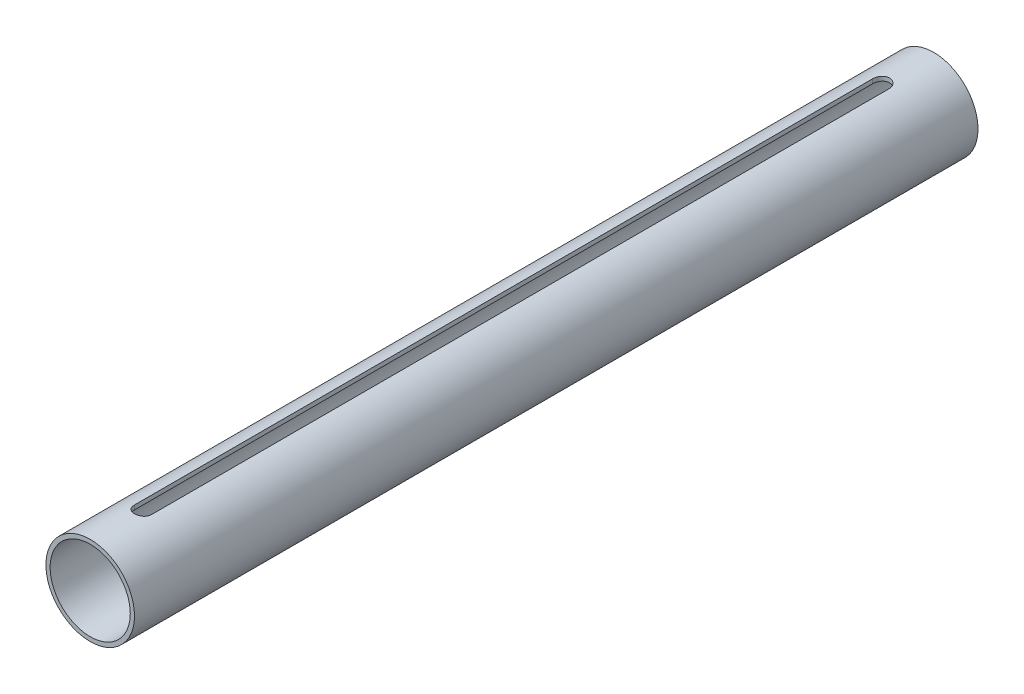
ISO-10303-21;
HEADER;
FILE_DESCRIPTION(('STEP AP214'),'2;1');
FILE_NAME('part.step','',(''),(''),'','','');
FILE_SCHEMA(('AUTOMOTIVE_DESIGN { 1 0 10303 214 1 1 1 1 }'));
ENDSEC;
DATA;
#1=APPLICATION_CONTEXT('core data for automotive mechanical design processes');
#2=APPLICATION_PROTOCOL_DEFINITION('international standard','automotive_design',2000,#1);
#3=PRODUCT_CONTEXT('',#1,'mechanical');
#4=PRODUCT('Part','Part','',(#3));
#5=PRODUCT_RELATED_PRODUCT_CATEGORY('part','',(#4));
#6=PRODUCT_DEFINITION_FORMATION('','',#4);
#7=PRODUCT_DEFINITION_CONTEXT('part definition',#1,'design');
#8=PRODUCT_DEFINITION('design','',#6,#7);
#9=PRODUCT_DEFINITION_SHAPE('','',#8);
#10=(LENGTH_UNIT() NAMED_UNIT(*) SI_UNIT(.MILLI.,.METRE.));
#11=(NAMED_UNIT(*) PLANE_ANGLE_UNIT() SI_UNIT($,.RADIAN.));
#12=(NAMED_UNIT(*) SI_UNIT($,.STERADIAN.) SOLID_ANGLE_UNIT());
#13=UNCERTAINTY_MEASURE_WITH_UNIT(LENGTH_MEASURE(1.E-05),#10,'distance_accuracy_value','');
#14=(GEOMETRIC_REPRESENTATION_CONTEXT(3) GLOBAL_UNCERTAINTY_ASSIGNED_CONTEXT((#13)) GLOBAL_UNIT_ASSIGNED_CONTEXT((#10,
#11,#12)) REPRESENTATION_CONTEXT('',''));
#15=CARTESIAN_POINT('',(0.,0.,0.));
#16=DIRECTION('',(0.,0.,1.));
#17=DIRECTION('',(1.,0.,0.));
#18=AXIS2_PLACEMENT_3D('',#15,#16,#17);
#19=CARTESIAN_POINT('',(0.,0.,200.));
#20=DIRECTION('',(0.,0.,1.));
#21=DIRECTION('',(1.,0.,0.));
#22=AXIS2_PLACEMENT_3D('',#19,#20,#21);
#23=PLANE('',#22);
#24=CARTESIAN_POINT('',(0.,0.,200.));
#25=DIRECTION('',(0.,0.,1.));
#26=DIRECTION('',(1.,0.,0.));
#27=AXIS2_PLACEMENT_3D('',#24,#25,#26);
#28=CIRCLE('',#27,21.);
#29=CARTESIAN_POINT('',(21.,0.,200.));
#30=VERTEX_POINT('',#29);
#31=EDGE_CURVE('E11',#30,#30,#28,.T.);
#32=ORIENTED_EDGE('',*,*,#31,.T.);
#33=EDGE_LOOP('',(#32));
#34=FACE_BOUND('',#33,.T.);
#35=CARTESIAN_POINT('',(0.,0.,200.));
#36=DIRECTION('',(0.,0.,1.));
#37=DIRECTION('',(1.,0.,0.));
#38=AXIS2_PLACEMENT_3D('',#35,#36,#37);
#39=CIRCLE('',#38,19.);
#40=CARTESIAN_POINT('',(19.,0.,200.));
#41=VERTEX_POINT('',#40);
#42=EDGE_CURVE('E149',#41,#41,#39,.T.);
#43=ORIENTED_EDGE('',*,*,#42,.F.);
#44=EDGE_LOOP('',(#43));
#45=FACE_BOUND('',#44,.T.);
#46=ADVANCED_FACE('F38',(#34,#45),#23,.T.);
#47=CARTESIAN_POINT('',(0.,0.,-200.));
#48=DIRECTION('',(0.,0.,1.));
#49=DIRECTION('',(1.,0.,0.));
#50=AXIS2_PLACEMENT_3D('',#47,#48,#49);
#51=PLANE('',#50);
#52=CARTESIAN_POINT('',(0.,0.,-200.));
#53=DIRECTION('',(0.,0.,1.));
#54=DIRECTION('',(1.,0.,0.));
#55=AXIS2_PLACEMENT_3D('',#52,#53,#54);
#56=CIRCLE('',#55,21.);
#57=CARTESIAN_POINT('',(21.,0.,-200.));
#58=VERTEX_POINT('',#57);
#59=EDGE_CURVE('E42',#58,#58,#56,.T.);
#60=ORIENTED_EDGE('',*,*,#59,.F.);
#61=EDGE_LOOP('',(#60));
#62=FACE_BOUND('',#61,.T.);
#63=CARTESIAN_POINT('',(0.,0.,-200.));
#64=DIRECTION('',(0.,0.,1.));
#65=DIRECTION('',(1.,0.,0.));
#66=AXIS2_PLACEMENT_3D('',#63,#64,#65);
#67=CIRCLE('',#66,19.);
#68=CARTESIAN_POINT('',(19.,0.,-200.));
#69=VERTEX_POINT('',#68);
#70=EDGE_CURVE('E148',#69,#69,#67,.T.);
#71=ORIENTED_EDGE('',*,*,#70,.T.);
#72=EDGE_LOOP('',(#71));
#73=FACE_BOUND('',#72,.T.);
#74=ADVANCED_FACE('F155',(#62,#73),#51,.F.);
#75=CARTESIAN_POINT('',(0.,0.,200.));
#76=DIRECTION('',(0.,0.,-1.));
#77=DIRECTION('',(-1.,0.,0.));
#78=AXIS2_PLACEMENT_3D('',#75,#76,#77);
#79=CYLINDRICAL_SURFACE('',#78,21.);
#80=CARTESIAN_POINT('',(3.99999999999994,20.6155281280883,-175.));
#81=CARTESIAN_POINT('',(4.00001196332782,20.6155189820401,-175.111414684024));
#82=CARTESIAN_POINT('',(3.99534516674248,20.6164311242063,-175.222822841809));
#83=CARTESIAN_POINT('',(3.97674682952954,20.6200302810058,-175.444821680965));
#84=CARTESIAN_POINT('',(3.96281636804235,20.622717088905,-175.555412456036));
#85=CARTESIAN_POINT('',(3.92581018028999,20.6297927890958,-175.774839852553));
#86=CARTESIAN_POINT('',(3.90274769169003,20.6341792174437,-175.883678776845));
#87=CARTESIAN_POINT('',(3.84768013098236,20.6445182979967,-176.098963037915));
#88=CARTESIAN_POINT('',(3.815675036314,20.6504709541531,-176.205408368653));
#89=CARTESIAN_POINT('',(3.70655818179204,20.6704372616691,-176.520065690625));
#90=CARTESIAN_POINT('',(3.61631662683918,20.6865649932166,-176.723765112328));
#91=CARTESIAN_POINT('',(3.40357727432139,20.7226258900229,-177.113042105835));
#92=CARTESIAN_POINT('',(3.28107701998045,20.7425593450884,-177.298618295922));
#93=CARTESIAN_POINT('',(3.00560745240965,20.7842705332213,-177.648866311636));
#94=CARTESIAN_POINT('',(2.85230702521075,20.8060666847781,-177.81327599441));
#95=CARTESIAN_POINT('',(2.5202970074748,20.8488865127962,-178.114213011358));
#96=CARTESIAN_POINT('',(2.341583501899,20.8699100696054,-178.250736041515));
#97=CARTESIAN_POINT('',(1.96208582504388,20.9090132250212,-178.49303391567));
#98=CARTESIAN_POINT('',(1.76113927869142,20.9270683954058,-178.598558746215));
#99=CARTESIAN_POINT('',(1.34397949443495,20.9579914402601,-178.77424515786));
#100=CARTESIAN_POINT('',(1.127768397823,20.9708600406031,-178.844411687784));
#101=CARTESIAN_POINT('',(0.688952431508268,20.989830288581,-178.946578801085));
#102=CARTESIAN_POINT('',(0.466455040325967,20.9960110739096,-178.979026070521));
#103=CARTESIAN_POINT('',(0.0190892089219379,21.0011822464174,-179.006225759139));
#104=CARTESIAN_POINT('',(-0.205779077669492,21.0001730966686,-179.000980605924));
#105=CARTESIAN_POINT('',(-0.648427398158166,20.9911395624239,-178.953284881849));
#106=CARTESIAN_POINT('',(-0.866261489713978,20.9832060598964,-178.911316287193));
#107=CARTESIAN_POINT('',(-1.29173644754499,20.9613173598491,-178.792127416963));
#108=CARTESIAN_POINT('',(-1.49937700504422,20.9473619800436,-178.714906074264));
#109=CARTESIAN_POINT('',(-1.89996723042171,20.9148460437857,-178.526948695719));
#110=CARTESIAN_POINT('',(-2.09282442863461,20.8962591746834,-178.416020343189));
#111=CARTESIAN_POINT('',(-2.45736312924986,20.8565346626125,-178.163933546303));
#112=CARTESIAN_POINT('',(-2.62904312422413,20.8353968382744,-178.022772951921));
#113=CARTESIAN_POINT('',(-2.94918311065104,20.7925192747643,-177.7116324245));
#114=CARTESIAN_POINT('',(-3.09723607952113,20.7707752961188,-177.541234693714));
#115=CARTESIAN_POINT('',(-3.36280629622467,20.7294397942655,-177.177647850254));
#116=CARTESIAN_POINT('',(-3.48031502350151,20.7098488725477,-176.984452399784));
#117=CARTESIAN_POINT('',(-3.63110625895221,20.6837534577744,-176.681633541582));
#118=CARTESIAN_POINT('',(-3.67718201809477,20.6755922678453,-176.578333586033));
#119=CARTESIAN_POINT('',(-3.76044825335203,20.6606104598112,-176.368131408291));
#120=CARTESIAN_POINT('',(-3.79764218832961,20.6537893200326,-176.261230606949));
#121=CARTESIAN_POINT('',(-3.8628191354587,20.6416987180988,-176.044703543216));
#122=CARTESIAN_POINT('',(-3.89081177415776,20.6364276348614,-175.935080259153));
#123=CARTESIAN_POINT('',(-3.93741194707864,20.6275871161522,-175.713832527409));
#124=CARTESIAN_POINT('',(-3.95602395642104,20.6240168693244,-175.602209060305));
#125=CARTESIAN_POINT('',(-3.97991159231232,20.6194182589363,-175.408679066927));
#126=CARTESIAN_POINT('',(-3.98744840004889,20.6179606518526,-175.327054308562));
#127=CARTESIAN_POINT('',(-3.99748970215931,20.6160151897321,-175.163622272254));
#128=CARTESIAN_POINT('',(-4.0000026386907,20.6155257078639,-175.081815532155));
#129=CARTESIAN_POINT('',(-3.99999999999996,20.6155281280883,-175.));
#130=B_SPLINE_CURVE_WITH_KNOTS('',3,(#80,#81,#82,#83,#84,#85,#86,#87,#88,#89,#90,#91,#92,#93,
#94,#95,#96,#97,#98,#99,#100,#101,#102,#103,#104,#105,#106,#107,#108,#109,#110,#111,#112,#113,
#114,#115,#116,#117,#118,#119,#120,#121,#122,#123,#124,#125,#126,#127,#128,#129),.UNSPECIFIED.,
.F.,.F.,(4,2,2,2,2,2,2,2,2,2,2,2,2,2,2,2,2,2,2,2,2,2,2,2,4),(0.,0.334131189783935,
0.668223462863074,1.00183320282418,1.33544378443276,2.00216557286643,2.66893815256189,
3.3433043951575,4.01777464073934,4.6975441386433,5.37721846807777,6.04875908524191,
6.72025645184234,7.38307075969946,8.04590513272865,8.71259469894392,9.37933169386544,
10.0565399812768,10.7339369790202,11.0738093566625,11.4135491606261,11.7529323834367,
12.092153546563,12.3379562589346,12.5833455739022),.UNSPECIFIED.);
#131=CARTESIAN_POINT('',(3.99999999999988,20.6155281280883,-175.));
#132=VERTEX_POINT('',#131);
#133=CARTESIAN_POINT('',(-4.00000000000017,20.6155281280883,-175.));
#134=VERTEX_POINT('',#133);
#135=EDGE_CURVE('E94',#132,#134,#130,.T.);
#136=ORIENTED_EDGE('',*,*,#135,.F.);
#137=DIRECTION('',(0.,0.,-1.));
#138=VECTOR('',#137,1.);
#139=CARTESIAN_POINT('',(3.99999999999988,20.6155281280883,200.));
#140=LINE('',#139,#138);
#141=CARTESIAN_POINT('',(3.99999999999987,20.6155281280883,175.));
#142=VERTEX_POINT('',#141);
#143=EDGE_CURVE('E145',#142,#132,#140,.T.);
#144=ORIENTED_EDGE('',*,*,#143,.F.);
#145=CARTESIAN_POINT('',(-3.99999999999997,20.6155281280883,175.));
#146=CARTESIAN_POINT('',(-4.00001196332785,20.6155189820401,175.111414684024));
#147=CARTESIAN_POINT('',(-3.99534516674251,20.6164311242063,175.222822841809));
#148=CARTESIAN_POINT('',(-3.97674682952957,20.6200302810058,175.444821680965));
#149=CARTESIAN_POINT('',(-3.96281636804237,20.622717088905,175.555412456036));
#150=CARTESIAN_POINT('',(-3.92581018029002,20.6297927890958,175.774839852553));
#151=CARTESIAN_POINT('',(-3.90274769169006,20.6341792174437,175.883678776845));
#152=CARTESIAN_POINT('',(-3.84768013098238,20.6445182979967,176.098963037915));
#153=CARTESIAN_POINT('',(-3.81567503631402,20.6504709541531,176.205408368653));
#154=CARTESIAN_POINT('',(-3.70655818179206,20.6704372616691,176.520065690625));
#155=CARTESIAN_POINT('',(-3.61631662683919,20.6865649932166,176.723765112328));
#156=CARTESIAN_POINT('',(-3.40357727432139,20.7226258900229,177.113042105835));
#157=CARTESIAN_POINT('',(-3.28107701998045,20.7425593450884,177.298618295922));
#158=CARTESIAN_POINT('',(-3.00560745240964,20.7842705332213,177.648866311636));
#159=CARTESIAN_POINT('',(-2.85230702521074,20.8060666847781,177.81327599441));
#160=CARTESIAN_POINT('',(-2.52029700747479,20.8488865127962,178.114213011358));
#161=CARTESIAN_POINT('',(-2.34158350189899,20.8699100696054,178.250736041515));
#162=CARTESIAN_POINT('',(-1.96208582504387,20.9090132250212,178.49303391567));
#163=CARTESIAN_POINT('',(-1.76113927869141,20.9270683954058,178.598558746215));
#164=CARTESIAN_POINT('',(-1.34397949443494,20.9579914402601,178.77424515786));
#165=CARTESIAN_POINT('',(-1.12776839782298,20.9708600406031,178.844411687784));
#166=CARTESIAN_POINT('',(-0.688952431508243,20.989830288581,178.946578801086));
#167=CARTESIAN_POINT('',(-0.466455040325939,20.9960110739096,178.979026070521));
#168=CARTESIAN_POINT('',(-0.0190892089219033,21.0011822464174,179.006225759139));
#169=CARTESIAN_POINT('',(0.20577907766953,21.0001730966686,179.000980605924));
#170=CARTESIAN_POINT('',(0.648427398158208,20.9911395624239,178.95328488185));
#171=CARTESIAN_POINT('',(0.86626148971402,20.9832060598964,178.911316287193));
#172=CARTESIAN_POINT('',(1.29173644754504,20.9613173598491,178.792127416963));
#173=CARTESIAN_POINT('',(1.49937700504427,20.9473619800436,178.714906074264));
#174=CARTESIAN_POINT('',(1.89996723042177,20.9148460437857,178.526948695719));
#175=CARTESIAN_POINT('',(2.09282442863467,20.8962591746834,178.416020343189));
#176=CARTESIAN_POINT('',(2.45736312924993,20.8565346626125,178.163933546303));
#177=CARTESIAN_POINT('',(2.62904312422419,20.8353968382744,178.022772951921));
#178=CARTESIAN_POINT('',(2.9491831106511,20.7925192747643,177.7116324245));
#179=CARTESIAN_POINT('',(3.09723607952121,20.7707752961188,177.541234693714));
#180=CARTESIAN_POINT('',(3.36280629622475,20.7294397942655,177.177647850254));
#181=CARTESIAN_POINT('',(3.48031502350158,20.7098488725477,176.984452399784));
#182=CARTESIAN_POINT('',(3.63110625895228,20.6837534577744,176.681633541582));
#183=CARTESIAN_POINT('',(3.67718201809485,20.6755922678452,176.578333586033));
#184=CARTESIAN_POINT('',(3.76044825335212,20.6606104598112,176.368131408291));
#185=CARTESIAN_POINT('',(3.79764218832969,20.6537893200326,176.261230606949));
#186=CARTESIAN_POINT('',(3.86281913545878,20.6416987180987,176.044703543216));
#187=CARTESIAN_POINT('',(3.89081177415785,20.6364276348614,175.935080259153));
#188=CARTESIAN_POINT('',(3.93741194707873,20.6275871161522,175.713832527409));
#189=CARTESIAN_POINT('',(3.95602395642112,20.6240168693244,175.602209060305));
#190=CARTESIAN_POINT('',(3.9799115923124,20.6194182589363,175.408679066927));
#191=CARTESIAN_POINT('',(3.98744840004897,20.6179606518526,175.327054308562));
#192=CARTESIAN_POINT('',(3.99748970215939,20.616015189732,175.163622272254));
#193=CARTESIAN_POINT('',(4.00000263869078,20.6155257078639,175.081815532155));
#194=CARTESIAN_POINT('',(4.00000000000003,20.6155281280883,175.));
#195=B_SPLINE_CURVE_WITH_KNOTS('',3,(#145,#146,#147,#148,#149,#150,#151,#152,#153,#154,#155,
#156,#157,#158,#159,#160,#161,#162,#163,#164,#165,#166,#167,#168,#169,#170,#171,#172,#173,#174,
#175,#176,#177,#178,#179,#180,#181,#182,#183,#184,#185,#186,#187,#188,#189,#190,#191,#192,#193,
#194),.UNSPECIFIED.,.F.,.F.,(4,2,2,2,2,2,2,2,2,2,2,2,2,2,2,2,2,2,2,2,2,2,2,2,4),(0.,
0.334131189783935,0.668223462863074,1.00183320282424,1.33544378443279,2.00216557286649,
2.66893815256195,3.3433043951576,4.01777464073941,4.69754413864338,5.37721846807785,
6.04875908524201,6.72025645184244,7.38307075969957,8.04590513272876,8.71259469894405,
9.37933169386558,10.056539981277,10.7339369790204,11.0738093566627,11.4135491606262,
11.7529323834369,12.0921535465632,12.3379562589347,12.5833455739024),.UNSPECIFIED.);
#196=CARTESIAN_POINT('',(-3.99999999999997,20.6155281280883,175.));
#197=VERTEX_POINT('',#196);
#198=EDGE_CURVE('E135',#197,#142,#195,.T.);
#199=ORIENTED_EDGE('',*,*,#198,.F.);
#200=DIRECTION('',(0.,0.,-1.));
#201=VECTOR('',#200,1.);
#202=CARTESIAN_POINT('',(-4.00000000000012,20.6155281280883,200.));
#203=LINE('',#202,#201);
#204=EDGE_CURVE('E53',#134,#197,#203,.F.);
#205=ORIENTED_EDGE('',*,*,#204,.F.);
#206=EDGE_LOOP('',(#136,#144,#199,#205));
#207=FACE_BOUND('',#206,.T.);
#208=ORIENTED_EDGE('',*,*,#31,.F.);
#209=EDGE_LOOP('',(#208));
#210=FACE_BOUND('',#209,.T.);
#211=ORIENTED_EDGE('',*,*,#59,.T.);
#212=EDGE_LOOP('',(#211));
#213=FACE_BOUND('',#212,.T.);
#214=ADVANCED_FACE('F40',(#207,#210,#213),#79,.T.);
#215=CARTESIAN_POINT('',(0.,0.,200.));
#216=DIRECTION('',(0.,0.,-1.));
#217=DIRECTION('',(-1.,0.,0.));
#218=AXIS2_PLACEMENT_3D('',#215,#216,#217);
#219=CYLINDRICAL_SURFACE('',#218,19.);
#220=DIRECTION('',(0.,0.,-1.));
#221=VECTOR('',#220,1.);
#222=CARTESIAN_POINT('',(3.99999999999988,18.5741756210067,200.));
#223=LINE('',#222,#221);
#224=CARTESIAN_POINT('',(4.00000000000003,18.5741756210067,175.));
#225=VERTEX_POINT('',#224);
#226=CARTESIAN_POINT('',(3.99999999999994,18.5741756210067,-175.));
#227=VERTEX_POINT('',#226);
#228=EDGE_CURVE('E100',#225,#227,#223,.T.);
#229=ORIENTED_EDGE('',*,*,#228,.T.);
#230=CARTESIAN_POINT('',(3.99999999999994,18.5741756210067,-175.));
#231=CARTESIAN_POINT('',(4.00001222490433,18.5741654217368,-175.111171791823));
#232=CARTESIAN_POINT('',(3.99536546086498,18.5751734897365,-175.222336732767));
#233=CARTESIAN_POINT('',(3.97684880325358,18.5791506159145,-175.44384622541));
#234=CARTESIAN_POINT('',(3.96298012853632,18.5821194149437,-175.554190883577));
#235=CARTESIAN_POINT('',(3.92614408416688,18.5899362077489,-175.773106816641));
#236=CARTESIAN_POINT('',(3.90319137743076,18.5947811728563,-175.881680657259));
#237=CARTESIAN_POINT('',(3.84839247292633,18.6061992956328,-176.096436581706));
#238=CARTESIAN_POINT('',(3.81654622261586,18.6127724635119,-176.202618651402));
#239=CARTESIAN_POINT('',(3.70798972816664,18.6348153916971,-176.5164785728));
#240=CARTESIAN_POINT('',(3.61823083559315,18.6526155537016,-176.719652335358));
#241=CARTESIAN_POINT('',(3.40666903007045,18.69240796827,-177.107981646773));
#242=CARTESIAN_POINT('',(3.28486177609813,18.7144007886276,-177.293134750033));
#243=CARTESIAN_POINT('',(3.01061669260297,18.7604835106797,-177.643155289969));
#244=CARTESIAN_POINT('',(2.85777589706056,18.7845983526632,-177.807704295726));
#245=CARTESIAN_POINT('',(2.52666611871797,18.8319908622583,-178.109033334465));
#246=CARTESIAN_POINT('',(2.3483931841958,18.8552683990617,-178.24580904393));
#247=CARTESIAN_POINT('',(1.96934380797486,18.8986340421515,-178.488962793934));
#248=CARTESIAN_POINT('',(1.76836605369869,18.9186890585766,-178.595033450975));
#249=CARTESIAN_POINT('',(1.35095794390716,18.9530658233109,-178.771771677595));
#250=CARTESIAN_POINT('',(1.13453002400906,18.9673884729487,-178.842444813342));
#251=CARTESIAN_POINT('',(0.695694605472301,18.9885107879679,-178.945384712156));
#252=CARTESIAN_POINT('',(0.473419793940062,18.9954168029993,-178.978194929169));
#253=CARTESIAN_POINT('',(0.0264154053333358,19.0012957492431,-179.006175100788));
#254=CARTESIAN_POINT('',(-0.198313965673784,19.0002693413705,-179.001348191251));
#255=CARTESIAN_POINT('',(-0.640096182038713,18.9904805819425,-178.954598047067));
#256=CARTESIAN_POINT('',(-0.857214202510462,18.9818405464064,-178.913261333206));
#257=CARTESIAN_POINT('',(-1.28135969455263,18.9579341194218,-178.795597316895));
#258=CARTESIAN_POINT('',(-1.48838680935688,18.9426674938776,-178.719268778294));
#259=CARTESIAN_POINT('',(-1.88812585543568,18.9070242447155,-178.533259376795));
#260=CARTESIAN_POINT('',(-2.08072933348604,18.8866131397767,-178.423352351904));
#261=CARTESIAN_POINT('',(-2.44497170163581,18.842924760551,-178.173467347074));
#262=CARTESIAN_POINT('',(-2.61660856929815,18.8196472102012,-178.033486469801));
#263=CARTESIAN_POINT('',(-2.93750266060761,18.7722649477445,-177.724279361793));
#264=CARTESIAN_POINT('',(-3.08626747937219,18.7481529338952,-177.554543681449));
#265=CARTESIAN_POINT('',(-3.35338751606727,18.7022254832106,-177.192122885758));
#266=CARTESIAN_POINT('',(-3.47173436523149,18.6804106793692,-176.999431475995));
#267=CARTESIAN_POINT('',(-3.62389526050959,18.6512745507568,-176.697124467659));
#268=CARTESIAN_POINT('',(-3.67046023920657,18.6421447448318,-176.593912004685));
#269=CARTESIAN_POINT('',(-3.75470710269065,18.6253597321498,-176.383820347688));
#270=CARTESIAN_POINT('',(-3.79239247246451,18.6177039470992,-176.276942611107));
#271=CARTESIAN_POINT('',(-3.858545103456,18.6041062481277,-176.060396518741));
#272=CARTESIAN_POINT('',(-3.88702194706815,18.5981625533135,-175.950731192775));
#273=CARTESIAN_POINT('',(-3.93457391635095,18.5881607141379,-175.729339685638));
#274=CARTESIAN_POINT('',(-3.95365349954491,18.5841016758556,-175.617614507685));
#275=CARTESIAN_POINT('',(-3.97863271518327,18.578767531634,-175.421452991203));
#276=CARTESIAN_POINT('',(-3.98664892862587,18.5770472187323,-175.337291760474));
#277=CARTESIAN_POINT('',(-3.99732974125029,18.5747506472721,-175.168756259525));
#278=CARTESIAN_POINT('',(-4.00000326179255,18.5741724815467,-175.084382580403));
#279=CARTESIAN_POINT('',(-3.99999999999996,18.5741756210067,-175.));
#280=B_SPLINE_CURVE_WITH_KNOTS('',3,(#230,#231,#232,#233,#234,#235,#236,#237,#238,#239,#240,
#241,#242,#243,#244,#245,#246,#247,#248,#249,#250,#251,#252,#253,#254,#255,#256,#257,#258,#259,
#260,#261,#262,#263,#264,#265,#266,#267,#268,#269,#270,#271,#272,#273,#274,#275,#276,#277,#278,
#279),.UNSPECIFIED.,.F.,.F.,(4,2,2,2,2,2,2,2,2,2,2,2,2,2,2,2,2,2,2,2,2,2,2,2,4),(0.,
0.333401795300901,0.666759533829197,0.999581366012337,1.33240516451503,1.99750494285632,
2.66269485688968,3.33714886818755,4.01170779254926,4.69280293530325,5.37379094397579,
6.04487801628811,6.71590917545121,7.37635256482139,8.03681928739948,8.70183637939655,
9.36691756830488,10.0447555389697,10.7227798011611,11.063231164732,11.4035486877081,
11.7435109279844,12.0833117539235,12.3368214921513,12.5899075586571),.UNSPECIFIED.);
#281=CARTESIAN_POINT('',(-3.99999999999996,18.5741756210067,-175.));
#282=VERTEX_POINT('',#281);
#283=EDGE_CURVE('E88',#227,#282,#280,.T.);
#284=ORIENTED_EDGE('',*,*,#283,.T.);
#285=DIRECTION('',(0.,0.,-1.));
#286=VECTOR('',#285,1.);
#287=CARTESIAN_POINT('',(-4.00000000000012,18.5741756210067,200.));
#288=LINE('',#287,#286);
#289=CARTESIAN_POINT('',(-4.00000000000012,18.5741756210067,175.));
#290=VERTEX_POINT('',#289);
#291=EDGE_CURVE('E78',#282,#290,#288,.F.);
#292=ORIENTED_EDGE('',*,*,#291,.T.);
#293=CARTESIAN_POINT('',(-3.99999999999997,18.5741756210067,175.));
#294=CARTESIAN_POINT('',(-4.00001222490436,18.5741654217368,175.111171791823));
#295=CARTESIAN_POINT('',(-3.995365460865,18.5751734897365,175.222336732767));
#296=CARTESIAN_POINT('',(-3.97684880325361,18.5791506159145,175.44384622541));
#297=CARTESIAN_POINT('',(-3.96298012853635,18.5821194149437,175.554190883577));
#298=CARTESIAN_POINT('',(-3.92614408416691,18.5899362077489,175.773106816641));
#299=CARTESIAN_POINT('',(-3.90319137743079,18.5947811728563,175.881680657259));
#300=CARTESIAN_POINT('',(-3.84839247292636,18.6061992956328,176.096436581706));
#301=CARTESIAN_POINT('',(-3.81654622261589,18.6127724635119,176.202618651402));
#302=CARTESIAN_POINT('',(-3.70798972816667,18.6348153916971,176.5164785728));
#303=CARTESIAN_POINT('',(-3.61823083559318,18.6526155537016,176.719652335358));
#304=CARTESIAN_POINT('',(-3.40666903007049,18.69240796827,177.107981646773));
#305=CARTESIAN_POINT('',(-3.28486177609817,18.7144007886276,177.293134750033));
#306=CARTESIAN_POINT('',(-3.01061669260301,18.7604835106797,177.643155289969));
#307=CARTESIAN_POINT('',(-2.85777589706058,18.7845983526632,177.807704295726));
#308=CARTESIAN_POINT('',(-2.52666611871799,18.8319908622583,178.109033334465));
#309=CARTESIAN_POINT('',(-2.34839318419583,18.8552683990617,178.24580904393));
#310=CARTESIAN_POINT('',(-1.96934380797489,18.8986340421515,178.488962793934));
#311=CARTESIAN_POINT('',(-1.76836605369871,18.9186890585766,178.595033450975));
#312=CARTESIAN_POINT('',(-1.35095794390718,18.9530658233109,178.771771677595));
#313=CARTESIAN_POINT('',(-1.13453002400908,18.9673884729487,178.842444813342));
#314=CARTESIAN_POINT('',(-0.69569460547232,18.9885107879679,178.945384712156));
#315=CARTESIAN_POINT('',(-0.473419793940074,18.9954168029993,178.978194929169));
#316=CARTESIAN_POINT('',(-0.0264154053333347,19.0012957492431,179.006175100788));
#317=CARTESIAN_POINT('',(0.198313965673791,19.0002693413705,179.001348191251));
#318=CARTESIAN_POINT('',(0.640096182038729,18.9904805819426,178.954598047068));
#319=CARTESIAN_POINT('',(0.857214202510479,18.9818405464064,178.913261333206));
#320=CARTESIAN_POINT('',(1.28135969455265,18.9579341194218,178.795597316895));
#321=CARTESIAN_POINT('',(1.4883868093569,18.9426674938776,178.719268778294));
#322=CARTESIAN_POINT('',(1.88812585543571,18.9070242447155,178.533259376795));
#323=CARTESIAN_POINT('',(2.08072933348608,18.8866131397767,178.423352351904));
#324=CARTESIAN_POINT('',(2.44497170163585,18.842924760551,178.173467347074));
#325=CARTESIAN_POINT('',(2.6166085692982,18.8196472102012,178.033486469801));
#326=CARTESIAN_POINT('',(2.93750266060766,18.7722649477445,177.724279361793));
#327=CARTESIAN_POINT('',(3.08626747937225,18.7481529338952,177.554543681449));
#328=CARTESIAN_POINT('',(3.35338751606734,18.7022254832106,177.192122885758));
#329=CARTESIAN_POINT('',(3.47173436523156,18.6804106793692,176.999431475995));
#330=CARTESIAN_POINT('',(3.62389526050966,18.6512745507568,176.697124467659));
#331=CARTESIAN_POINT('',(3.67046023920663,18.6421447448318,176.593912004685));
#332=CARTESIAN_POINT('',(3.75470710269071,18.6253597321498,176.383820347688));
#333=CARTESIAN_POINT('',(3.79239247246458,18.6177039470992,176.276942611107));
#334=CARTESIAN_POINT('',(3.85854510345608,18.6041062481277,176.060396518741));
#335=CARTESIAN_POINT('',(3.88702194706823,18.5981625533135,175.950731192775));
#336=CARTESIAN_POINT('',(3.93457391635102,18.5881607141379,175.729339685638));
#337=CARTESIAN_POINT('',(3.95365349954499,18.5841016758556,175.617614507685));
#338=CARTESIAN_POINT('',(3.97863271518335,18.578767531634,175.421452991203));
#339=CARTESIAN_POINT('',(3.98664892862594,18.5770472187323,175.337291760474));
#340=CARTESIAN_POINT('',(3.99732974125037,18.5747506472721,175.168756259525));
#341=CARTESIAN_POINT('',(4.00000326179263,18.5741724815466,175.084382580403));
#342=CARTESIAN_POINT('',(4.00000000000003,18.5741756210067,175.));
#343=B_SPLINE_CURVE_WITH_KNOTS('',3,(#293,#294,#295,#296,#297,#298,#299,#300,#301,#302,#303,
#304,#305,#306,#307,#308,#309,#310,#311,#312,#313,#314,#315,#316,#317,#318,#319,#320,#321,#322,
#323,#324,#325,#326,#327,#328,#329,#330,#331,#332,#333,#334,#335,#336,#337,#338,#339,#340,#341,
#342),.UNSPECIFIED.,.F.,.F.,(4,2,2,2,2,2,2,2,2,2,2,2,2,2,2,2,2,2,2,2,2,2,2,2,4),(0.,
0.333401795300901,0.666759533829197,0.999581366012337,1.33240516451503,1.99750494285632,
2.66269485688967,3.33714886818758,4.01170779254928,4.69280293530328,5.37379094397583,
6.04487801628816,6.71590917545128,7.37635256482146,8.03681928739956,8.70183637939664,
9.36691756830498,10.0447555389698,10.7227798011612,11.0632311647321,11.4035486877083,
11.7435109279845,12.0833117539237,12.3368214921515,12.5899075586573),.UNSPECIFIED.);
#344=EDGE_CURVE('E87',#290,#225,#343,.T.);
#345=ORIENTED_EDGE('',*,*,#344,.T.);
#346=EDGE_LOOP('',(#229,#284,#292,#345));
#347=FACE_BOUND('',#346,.T.);
#348=ORIENTED_EDGE('',*,*,#42,.T.);
#349=EDGE_LOOP('',(#348));
#350=FACE_BOUND('',#349,.T.);
#351=ORIENTED_EDGE('',*,*,#70,.F.);
#352=EDGE_LOOP('',(#351));
#353=FACE_BOUND('',#352,.T.);
#354=ADVANCED_FACE('F98',(#347,#350,#353),#219,.F.);
#355=CARTESIAN_POINT('',(3.99999999999987,-21.001,175.));
#356=DIRECTION('',(1.,0.,0.));
#357=DIRECTION('',(0.,0.,-1.));
#358=AXIS2_PLACEMENT_3D('',#355,#356,#357);
#359=PLANE('',#358);
#360=ORIENTED_EDGE('',*,*,#143,.T.);
#361=DIRECTION('',(0.,1.,0.));
#362=VECTOR('',#361,1.);
#363=CARTESIAN_POINT('',(3.99999999999994,-21.001,-175.));
#364=LINE('',#363,#362);
#365=EDGE_CURVE('E95',#227,#132,#364,.T.);
#366=ORIENTED_EDGE('',*,*,#365,.F.);
#367=ORIENTED_EDGE('',*,*,#228,.F.);
#368=DIRECTION('',(0.,1.,0.));
#369=VECTOR('',#368,1.);
#370=CARTESIAN_POINT('',(3.99999999999987,-21.001,175.));
#371=LINE('',#370,#369);
#372=EDGE_CURVE('E61',#225,#142,#371,.T.);
#373=ORIENTED_EDGE('',*,*,#372,.T.);
#374=EDGE_LOOP('',(#360,#366,#367,#373));
#375=FACE_BOUND('',#374,.T.);
#376=ADVANCED_FACE('F131',(#375),#359,.F.);
#377=CARTESIAN_POINT('',(0.,-21.001,-175.));
#378=DIRECTION('',(0.,1.,0.));
#379=DIRECTION('',(0.,0.,1.));
#380=AXIS2_PLACEMENT_3D('',#377,#378,#379);
#381=CYLINDRICAL_SURFACE('',#380,3.99999999999995);
#382=ORIENTED_EDGE('',*,*,#135,.T.);
#383=DIRECTION('',(0.,1.,0.));
#384=VECTOR('',#383,1.);
#385=CARTESIAN_POINT('',(-4.00000000000017,-21.001,-175.));
#386=LINE('',#385,#384);
#387=EDGE_CURVE('E81',#282,#134,#386,.T.);
#388=ORIENTED_EDGE('',*,*,#387,.F.);
#389=ORIENTED_EDGE('',*,*,#283,.F.);
#390=ORIENTED_EDGE('',*,*,#365,.T.);
#391=EDGE_LOOP('',(#382,#388,#389,#390));
#392=FACE_BOUND('',#391,.T.);
#393=ADVANCED_FACE('F91',(#392),#381,.F.);
#394=CARTESIAN_POINT('',(-4.00000000000013,-21.001,175.));
#395=DIRECTION('',(-1.,0.,0.));
#396=DIRECTION('',(0.,0.,1.));
#397=AXIS2_PLACEMENT_3D('',#394,#395,#396);
#398=PLANE('',#397);
#399=ORIENTED_EDGE('',*,*,#204,.T.);
#400=DIRECTION('',(0.,1.,0.));
#401=VECTOR('',#400,1.);
#402=CARTESIAN_POINT('',(-4.00000000000013,-21.001,175.));
#403=LINE('',#402,#401);
#404=EDGE_CURVE('E83',#290,#197,#403,.T.);
#405=ORIENTED_EDGE('',*,*,#404,.F.);
#406=ORIENTED_EDGE('',*,*,#291,.F.);
#407=ORIENTED_EDGE('',*,*,#387,.T.);
#408=EDGE_LOOP('',(#399,#405,#406,#407));
#409=FACE_BOUND('',#408,.T.);
#410=ADVANCED_FACE('F80',(#409),#398,.F.);
#411=CARTESIAN_POINT('',(0.,-21.001,175.));
#412=DIRECTION('',(0.,1.,0.));
#413=DIRECTION('',(0.,0.,1.));
#414=AXIS2_PLACEMENT_3D('',#411,#412,#413);
#415=CYLINDRICAL_SURFACE('',#414,4.);
#416=ORIENTED_EDGE('',*,*,#198,.T.);
#417=ORIENTED_EDGE('',*,*,#372,.F.);
#418=ORIENTED_EDGE('',*,*,#344,.F.);
#419=ORIENTED_EDGE('',*,*,#404,.T.);
#420=EDGE_LOOP('',(#416,#417,#418,#419));
#421=FACE_BOUND('',#420,.T.);
#422=ADVANCED_FACE('F127',(#421),#415,.F.);
#423=CLOSED_SHELL('',(#46,#74,#214,#354,#376,#393,#410,#422));
#424=MANIFOLD_SOLID_BREP('B2',#423);
#425=ADVANCED_BREP_SHAPE_REPRESENTATION('',(#18,#424),#14);
#426=SHAPE_DEFINITION_REPRESENTATION(#9,#425);
ENDSEC;
END-ISO-10303-21;
